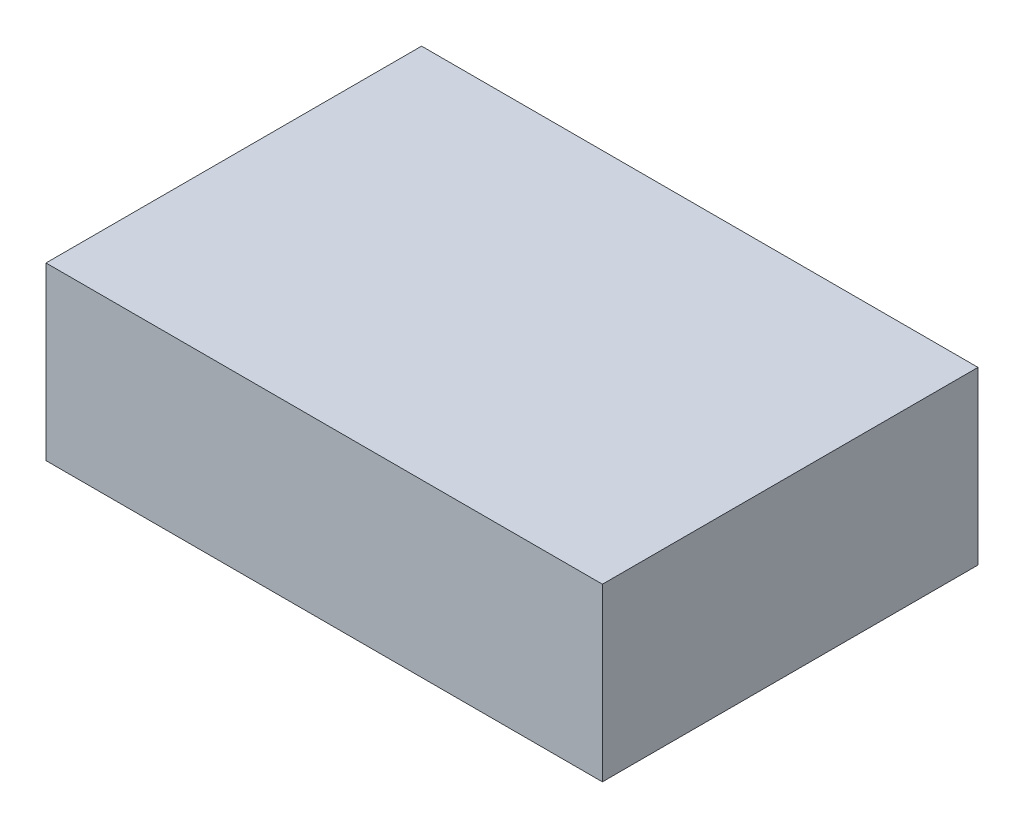
ISO-10303-21;
HEADER;
FILE_DESCRIPTION(('STEP AP214'),'2;1');
FILE_NAME('part.step','',(''),(''),'','','');
FILE_SCHEMA(('AUTOMOTIVE_DESIGN { 1 0 10303 214 1 1 1 1 }'));
ENDSEC;
DATA;
#1=APPLICATION_CONTEXT('core data for automotive mechanical design processes');
#2=APPLICATION_PROTOCOL_DEFINITION('international standard','automotive_design',2000,#1);
#3=PRODUCT_CONTEXT('',#1,'mechanical');
#4=PRODUCT('Part','Part','',(#3));
#5=PRODUCT_RELATED_PRODUCT_CATEGORY('part','',(#4));
#6=PRODUCT_DEFINITION_FORMATION('','',#4);
#7=PRODUCT_DEFINITION_CONTEXT('part definition',#1,'design');
#8=PRODUCT_DEFINITION('design','',#6,#7);
#9=PRODUCT_DEFINITION_SHAPE('','',#8);
#10=(LENGTH_UNIT() NAMED_UNIT(*) SI_UNIT(.MILLI.,.METRE.));
#11=(NAMED_UNIT(*) PLANE_ANGLE_UNIT() SI_UNIT($,.RADIAN.));
#12=(NAMED_UNIT(*) SI_UNIT($,.STERADIAN.) SOLID_ANGLE_UNIT());
#13=UNCERTAINTY_MEASURE_WITH_UNIT(LENGTH_MEASURE(1.E-05),#10,'distance_accuracy_value','');
#14=(GEOMETRIC_REPRESENTATION_CONTEXT(3) GLOBAL_UNCERTAINTY_ASSIGNED_CONTEXT((#13)) GLOBAL_UNIT_ASSIGNED_CONTEXT((#10,
#11,#12)) REPRESENTATION_CONTEXT('',''));
#15=CARTESIAN_POINT('',(0.,0.,0.));
#16=DIRECTION('',(0.,0.,1.));
#17=DIRECTION('',(1.,0.,0.));
#18=AXIS2_PLACEMENT_3D('',#15,#16,#17);
#19=CARTESIAN_POINT('',(0.25999948,-0.0799973,0.));
#20=DIRECTION('',(0.,-1.,0.));
#21=DIRECTION('',(0.,0.,-1.));
#22=AXIS2_PLACEMENT_3D('',#19,#20,#21);
#23=PLANE('',#22);
#24=DIRECTION('',(0.,0.,1.));
#25=VECTOR('',#24,1.);
#26=CARTESIAN_POINT('',(-0.25999948,-0.0799973,0.));
#27=LINE('',#26,#25);
#28=CARTESIAN_POINT('',(-0.25999948,-0.0799973,0.));
#29=VERTEX_POINT('',#28);
#30=CARTESIAN_POINT('',(-0.25999948,-0.0799973,0.35100006));
#31=VERTEX_POINT('',#30);
#32=EDGE_CURVE('E19',#29,#31,#27,.T.);
#33=ORIENTED_EDGE('',*,*,#32,.F.);
#34=DIRECTION('',(1.,0.,0.));
#35=VECTOR('',#34,1.);
#36=CARTESIAN_POINT('',(-0.25999948,-0.0799973,0.));
#37=LINE('',#36,#35);
#38=CARTESIAN_POINT('',(0.25999948,-0.0799973,0.));
#39=VERTEX_POINT('',#38);
#40=EDGE_CURVE('E79',#29,#39,#37,.T.);
#41=ORIENTED_EDGE('',*,*,#40,.T.);
#42=DIRECTION('',(0.,0.,-1.));
#43=VECTOR('',#42,1.);
#44=CARTESIAN_POINT('',(0.25999948,-0.0799973,0.));
#45=LINE('',#44,#43);
#46=CARTESIAN_POINT('',(0.25999948,-0.0799973,0.35100006));
#47=VERTEX_POINT('',#46);
#48=EDGE_CURVE('E67',#47,#39,#45,.T.);
#49=ORIENTED_EDGE('',*,*,#48,.F.);
#50=DIRECTION('',(1.,0.,0.));
#51=VECTOR('',#50,1.);
#52=CARTESIAN_POINT('',(-0.25999948,-0.0799973,0.35100006));
#53=LINE('',#52,#51);
#54=EDGE_CURVE('E55',#31,#47,#53,.T.);
#55=ORIENTED_EDGE('',*,*,#54,.F.);
#56=EDGE_LOOP('',(#33,#41,#49,#55));
#57=FACE_BOUND('',#56,.T.);
#58=ADVANCED_FACE('F16',(#57),#23,.T.);
#59=CARTESIAN_POINT('',(-0.25999948,-0.0799973,0.));
#60=DIRECTION('',(-1.,0.,0.));
#61=DIRECTION('',(0.,0.,1.));
#62=AXIS2_PLACEMENT_3D('',#59,#60,#61);
#63=PLANE('',#62);
#64=DIRECTION('',(0.,0.,1.));
#65=VECTOR('',#64,1.);
#66=CARTESIAN_POINT('',(-0.25999948,0.07999984,0.));
#67=LINE('',#66,#65);
#68=CARTESIAN_POINT('',(-0.25999948,0.07999984,0.));
#69=VERTEX_POINT('',#68);
#70=CARTESIAN_POINT('',(-0.25999948,0.07999984,0.35100006));
#71=VERTEX_POINT('',#70);
#72=EDGE_CURVE('E82',#69,#71,#67,.T.);
#73=ORIENTED_EDGE('',*,*,#72,.F.);
#74=DIRECTION('',(0.,1.,0.));
#75=VECTOR('',#74,1.);
#76=CARTESIAN_POINT('',(-0.25999948,0.07999984,0.));
#77=LINE('',#76,#75);
#78=EDGE_CURVE('E64',#69,#29,#77,.F.);
#79=ORIENTED_EDGE('',*,*,#78,.T.);
#80=ORIENTED_EDGE('',*,*,#32,.T.);
#81=DIRECTION('',(0.,1.,0.));
#82=VECTOR('',#81,1.);
#83=CARTESIAN_POINT('',(-0.25999948,0.07999984,0.35100006));
#84=LINE('',#83,#82);
#85=EDGE_CURVE('E61',#71,#31,#84,.F.);
#86=ORIENTED_EDGE('',*,*,#85,.F.);
#87=EDGE_LOOP('',(#73,#79,#80,#86));
#88=FACE_BOUND('',#87,.T.);
#89=ADVANCED_FACE('F60',(#88),#63,.T.);
#90=CARTESIAN_POINT('',(-0.25999948,0.07999984,0.35100006));
#91=DIRECTION('',(0.,0.,1.));
#92=DIRECTION('',(1.,0.,0.));
#93=AXIS2_PLACEMENT_3D('',#90,#91,#92);
#94=PLANE('',#93);
#95=DIRECTION('',(0.,1.,0.));
#96=VECTOR('',#95,1.);
#97=CARTESIAN_POINT('',(0.25999948,0.07999984,0.35100006));
#98=LINE('',#97,#96);
#99=CARTESIAN_POINT('',(0.25999948,0.07999984,0.35100006));
#100=VERTEX_POINT('',#99);
#101=EDGE_CURVE('E69',#100,#47,#98,.F.);
#102=ORIENTED_EDGE('',*,*,#101,.F.);
#103=DIRECTION('',(1.,0.,0.));
#104=VECTOR('',#103,1.);
#105=CARTESIAN_POINT('',(-0.25999948,0.07999984,0.35100006));
#106=LINE('',#105,#104);
#107=EDGE_CURVE('E73',#71,#100,#106,.T.);
#108=ORIENTED_EDGE('',*,*,#107,.F.);
#109=ORIENTED_EDGE('',*,*,#85,.T.);
#110=ORIENTED_EDGE('',*,*,#54,.T.);
#111=EDGE_LOOP('',(#102,#108,#109,#110));
#112=FACE_BOUND('',#111,.T.);
#113=ADVANCED_FACE('F71',(#112),#94,.T.);
#114=CARTESIAN_POINT('',(0.25999948,0.07999984,0.));
#115=DIRECTION('',(1.,0.,0.));
#116=DIRECTION('',(0.,0.,-1.));
#117=AXIS2_PLACEMENT_3D('',#114,#115,#116);
#118=PLANE('',#117);
#119=ORIENTED_EDGE('',*,*,#48,.T.);
#120=DIRECTION('',(0.,1.,0.));
#121=VECTOR('',#120,1.);
#122=CARTESIAN_POINT('',(0.25999948,0.07999984,0.));
#123=LINE('',#122,#121);
#124=CARTESIAN_POINT('',(0.25999948,0.07999984,0.));
#125=VERTEX_POINT('',#124);
#126=EDGE_CURVE('E34',#39,#125,#123,.T.);
#127=ORIENTED_EDGE('',*,*,#126,.T.);
#128=DIRECTION('',(0.,0.,1.));
#129=VECTOR('',#128,1.);
#130=CARTESIAN_POINT('',(0.25999948,0.07999984,0.));
#131=LINE('',#130,#129);
#132=EDGE_CURVE('E25',#100,#125,#131,.F.);
#133=ORIENTED_EDGE('',*,*,#132,.F.);
#134=ORIENTED_EDGE('',*,*,#101,.T.);
#135=EDGE_LOOP('',(#119,#127,#133,#134));
#136=FACE_BOUND('',#135,.T.);
#137=ADVANCED_FACE('F88',(#136),#118,.T.);
#138=CARTESIAN_POINT('',(-0.25999948,0.07999984,0.));
#139=DIRECTION('',(0.,0.,1.));
#140=DIRECTION('',(1.,0.,0.));
#141=AXIS2_PLACEMENT_3D('',#138,#139,#140);
#142=PLANE('',#141);
#143=ORIENTED_EDGE('',*,*,#126,.F.);
#144=ORIENTED_EDGE('',*,*,#40,.F.);
#145=ORIENTED_EDGE('',*,*,#78,.F.);
#146=DIRECTION('',(1.,0.,0.));
#147=VECTOR('',#146,1.);
#148=CARTESIAN_POINT('',(-0.25999948,0.07999984,0.));
#149=LINE('',#148,#147);
#150=EDGE_CURVE('E11',#125,#69,#149,.F.);
#151=ORIENTED_EDGE('',*,*,#150,.F.);
#152=EDGE_LOOP('',(#143,#144,#145,#151));
#153=FACE_BOUND('',#152,.T.);
#154=ADVANCED_FACE('F90',(#153),#142,.F.);
#155=CARTESIAN_POINT('',(-0.25999948,0.07999984,0.));
#156=DIRECTION('',(0.,1.,0.));
#157=DIRECTION('',(0.,0.,1.));
#158=AXIS2_PLACEMENT_3D('',#155,#156,#157);
#159=PLANE('',#158);
#160=ORIENTED_EDGE('',*,*,#132,.T.);
#161=ORIENTED_EDGE('',*,*,#150,.T.);
#162=ORIENTED_EDGE('',*,*,#72,.T.);
#163=ORIENTED_EDGE('',*,*,#107,.T.);
#164=EDGE_LOOP('',(#160,#161,#162,#163));
#165=FACE_BOUND('',#164,.T.);
#166=ADVANCED_FACE('F87',(#165),#159,.T.);
#167=CLOSED_SHELL('',(#58,#89,#113,#137,#154,#166));
#168=MANIFOLD_SOLID_BREP('B1',#167);
#169=ADVANCED_BREP_SHAPE_REPRESENTATION('',(#18,#168),#14);
#170=SHAPE_DEFINITION_REPRESENTATION(#9,#169);
ENDSEC;
END-ISO-10303-21;
